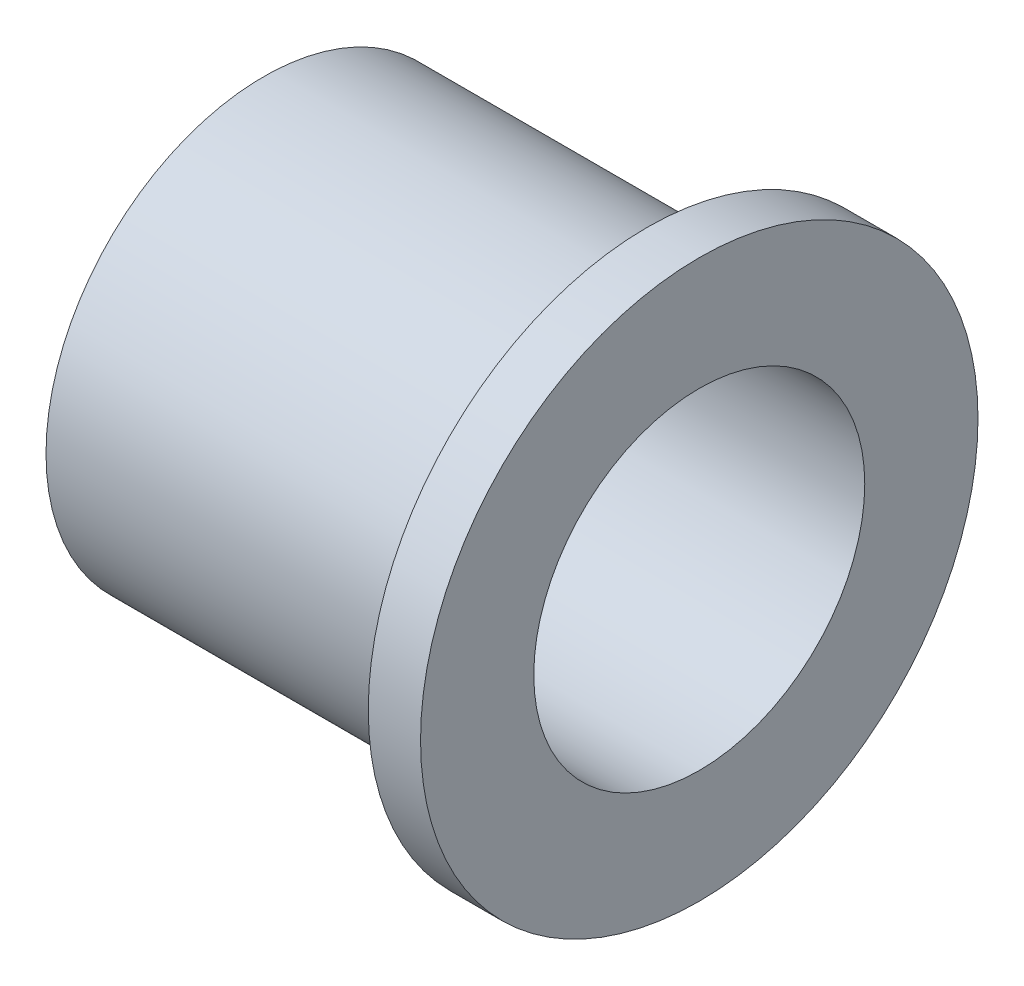
ISO-10303-21;
HEADER;
FILE_DESCRIPTION(('STEP AP214'),'2;1');
FILE_NAME('part.step','',(''),(''),'','','');
FILE_SCHEMA(('AUTOMOTIVE_DESIGN { 1 0 10303 214 1 1 1 1 }'));
ENDSEC;
DATA;
#1=APPLICATION_CONTEXT('core data for automotive mechanical design processes');
#2=APPLICATION_PROTOCOL_DEFINITION('international standard','automotive_design',2000,#1);
#3=PRODUCT_CONTEXT('',#1,'mechanical');
#4=PRODUCT('Part','Part','',(#3));
#5=PRODUCT_RELATED_PRODUCT_CATEGORY('part','',(#4));
#6=PRODUCT_DEFINITION_FORMATION('','',#4);
#7=PRODUCT_DEFINITION_CONTEXT('part definition',#1,'design');
#8=PRODUCT_DEFINITION('design','',#6,#7);
#9=PRODUCT_DEFINITION_SHAPE('','',#8);
#10=(LENGTH_UNIT() NAMED_UNIT(*) SI_UNIT(.MILLI.,.METRE.));
#11=(NAMED_UNIT(*) PLANE_ANGLE_UNIT() SI_UNIT($,.RADIAN.));
#12=(NAMED_UNIT(*) SI_UNIT($,.STERADIAN.) SOLID_ANGLE_UNIT());
#13=UNCERTAINTY_MEASURE_WITH_UNIT(LENGTH_MEASURE(1.E-05),#10,'distance_accuracy_value','');
#14=(GEOMETRIC_REPRESENTATION_CONTEXT(3) GLOBAL_UNCERTAINTY_ASSIGNED_CONTEXT((#13)) GLOBAL_UNIT_ASSIGNED_CONTEXT((#10,
#11,#12)) REPRESENTATION_CONTEXT('',''));
#15=CARTESIAN_POINT('',(0.,0.,0.));
#16=DIRECTION('',(0.,0.,1.));
#17=DIRECTION('',(1.,0.,0.));
#18=AXIS2_PLACEMENT_3D('',#15,#16,#17);
#19=CARTESIAN_POINT('',(22.,0.,0.));
#20=DIRECTION('',(-1.,0.,0.));
#21=DIRECTION('',(0.,0.,1.));
#22=AXIS2_PLACEMENT_3D('',#19,#20,#21);
#23=CYLINDRICAL_SURFACE('',#22,12.5);
#24=CARTESIAN_POINT('',(22.,0.,0.));
#25=DIRECTION('',(1.,0.,0.));
#26=DIRECTION('',(0.,0.,-1.));
#27=AXIS2_PLACEMENT_3D('',#24,#25,#26);
#28=CIRCLE('',#27,12.5);
#29=CARTESIAN_POINT('',(22.,0.,-12.5));
#30=VERTEX_POINT('',#29);
#31=EDGE_CURVE('E10',#30,#30,#28,.T.);
#32=ORIENTED_EDGE('',*,*,#31,.F.);
#33=EDGE_LOOP('',(#32));
#34=FACE_BOUND('',#33,.T.);
#35=CARTESIAN_POINT('',(0.,0.,0.));
#36=DIRECTION('',(1.,0.,0.));
#37=DIRECTION('',(0.,0.,-1.));
#38=AXIS2_PLACEMENT_3D('',#35,#36,#37);
#39=CIRCLE('',#38,12.5);
#40=CARTESIAN_POINT('',(0.,0.,-12.5));
#41=VERTEX_POINT('',#40);
#42=EDGE_CURVE('E32',#41,#41,#39,.T.);
#43=ORIENTED_EDGE('',*,*,#42,.T.);
#44=EDGE_LOOP('',(#43));
#45=FACE_BOUND('',#44,.T.);
#46=ADVANCED_FACE('F29',(#34,#45),#23,.T.);
#47=CARTESIAN_POINT('',(0.,0.,0.));
#48=DIRECTION('',(1.,0.,0.));
#49=DIRECTION('',(0.,0.,-1.));
#50=AXIS2_PLACEMENT_3D('',#47,#48,#49);
#51=PLANE('',#50);
#52=CARTESIAN_POINT('',(0.,0.,0.));
#53=DIRECTION('',(1.,0.,0.));
#54=DIRECTION('',(0.,0.,-1.));
#55=AXIS2_PLACEMENT_3D('',#52,#53,#54);
#56=CIRCLE('',#55,9.5);
#57=CARTESIAN_POINT('',(0.,0.,-9.5));
#58=VERTEX_POINT('',#57);
#59=EDGE_CURVE('E44',#58,#58,#56,.T.);
#60=ORIENTED_EDGE('',*,*,#59,.T.);
#61=EDGE_LOOP('',(#60));
#62=FACE_BOUND('',#61,.T.);
#63=ORIENTED_EDGE('',*,*,#42,.F.);
#64=EDGE_LOOP('',(#63));
#65=FACE_BOUND('',#64,.T.);
#66=ADVANCED_FACE('F53',(#62,#65),#51,.F.);
#67=CARTESIAN_POINT('',(22.,0.,0.));
#68=DIRECTION('',(1.,0.,0.));
#69=DIRECTION('',(0.,0.,-1.));
#70=AXIS2_PLACEMENT_3D('',#67,#68,#69);
#71=PLANE('',#70);
#72=CARTESIAN_POINT('',(22.,0.,0.));
#73=DIRECTION('',(1.,0.,0.));
#74=DIRECTION('',(0.,0.,-1.));
#75=AXIS2_PLACEMENT_3D('',#72,#73,#74);
#76=CIRCLE('',#75,16.);
#77=CARTESIAN_POINT('',(22.,0.,-16.));
#78=VERTEX_POINT('',#77);
#79=EDGE_CURVE('E41',#78,#78,#76,.T.);
#80=ORIENTED_EDGE('',*,*,#79,.F.);
#81=EDGE_LOOP('',(#80));
#82=FACE_BOUND('',#81,.T.);
#83=ORIENTED_EDGE('',*,*,#31,.T.);
#84=EDGE_LOOP('',(#83));
#85=FACE_BOUND('',#84,.T.);
#86=ADVANCED_FACE('F71',(#82,#85),#71,.F.);
#87=CARTESIAN_POINT('',(25.,0.,0.));
#88=DIRECTION('',(-1.,0.,0.));
#89=DIRECTION('',(0.,0.,1.));
#90=AXIS2_PLACEMENT_3D('',#87,#88,#89);
#91=CYLINDRICAL_SURFACE('',#90,16.);
#92=CARTESIAN_POINT('',(25.,0.,0.));
#93=DIRECTION('',(1.,0.,0.));
#94=DIRECTION('',(0.,0.,-1.));
#95=AXIS2_PLACEMENT_3D('',#92,#93,#94);
#96=CIRCLE('',#95,16.);
#97=CARTESIAN_POINT('',(25.,0.,-16.));
#98=VERTEX_POINT('',#97);
#99=EDGE_CURVE('E39',#98,#98,#96,.T.);
#100=ORIENTED_EDGE('',*,*,#99,.F.);
#101=EDGE_LOOP('',(#100));
#102=FACE_BOUND('',#101,.T.);
#103=ORIENTED_EDGE('',*,*,#79,.T.);
#104=EDGE_LOOP('',(#103));
#105=FACE_BOUND('',#104,.T.);
#106=ADVANCED_FACE('F65',(#102,#105),#91,.T.);
#107=CARTESIAN_POINT('',(25.,0.,0.));
#108=DIRECTION('',(1.,0.,0.));
#109=DIRECTION('',(0.,0.,-1.));
#110=AXIS2_PLACEMENT_3D('',#107,#108,#109);
#111=PLANE('',#110);
#112=CARTESIAN_POINT('',(25.,0.,0.));
#113=DIRECTION('',(1.,0.,0.));
#114=DIRECTION('',(0.,0.,-1.));
#115=AXIS2_PLACEMENT_3D('',#112,#113,#114);
#116=CIRCLE('',#115,9.5);
#117=CARTESIAN_POINT('',(25.,0.,-9.5));
#118=VERTEX_POINT('',#117);
#119=EDGE_CURVE('E47',#118,#118,#116,.T.);
#120=ORIENTED_EDGE('',*,*,#119,.F.);
#121=EDGE_LOOP('',(#120));
#122=FACE_BOUND('',#121,.T.);
#123=ORIENTED_EDGE('',*,*,#99,.T.);
#124=EDGE_LOOP('',(#123));
#125=FACE_BOUND('',#124,.T.);
#126=ADVANCED_FACE('F59',(#122,#125),#111,.T.);
#127=CARTESIAN_POINT('',(0.,0.,0.));
#128=DIRECTION('',(1.,0.,0.));
#129=DIRECTION('',(0.,0.,-1.));
#130=AXIS2_PLACEMENT_3D('',#127,#128,#129);
#131=CYLINDRICAL_SURFACE('',#130,9.5);
#132=ORIENTED_EDGE('',*,*,#59,.F.);
#133=EDGE_LOOP('',(#132));
#134=FACE_BOUND('',#133,.T.);
#135=ORIENTED_EDGE('',*,*,#119,.T.);
#136=EDGE_LOOP('',(#135));
#137=FACE_BOUND('',#136,.T.);
#138=ADVANCED_FACE('F56',(#134,#137),#131,.F.);
#139=CLOSED_SHELL('',(#46,#66,#86,#106,#126,#138));
#140=MANIFOLD_SOLID_BREP('B2',#139);
#141=ADVANCED_BREP_SHAPE_REPRESENTATION('',(#18,#140),#14);
#142=SHAPE_DEFINITION_REPRESENTATION(#9,#141);
ENDSEC;
END-ISO-10303-21;
